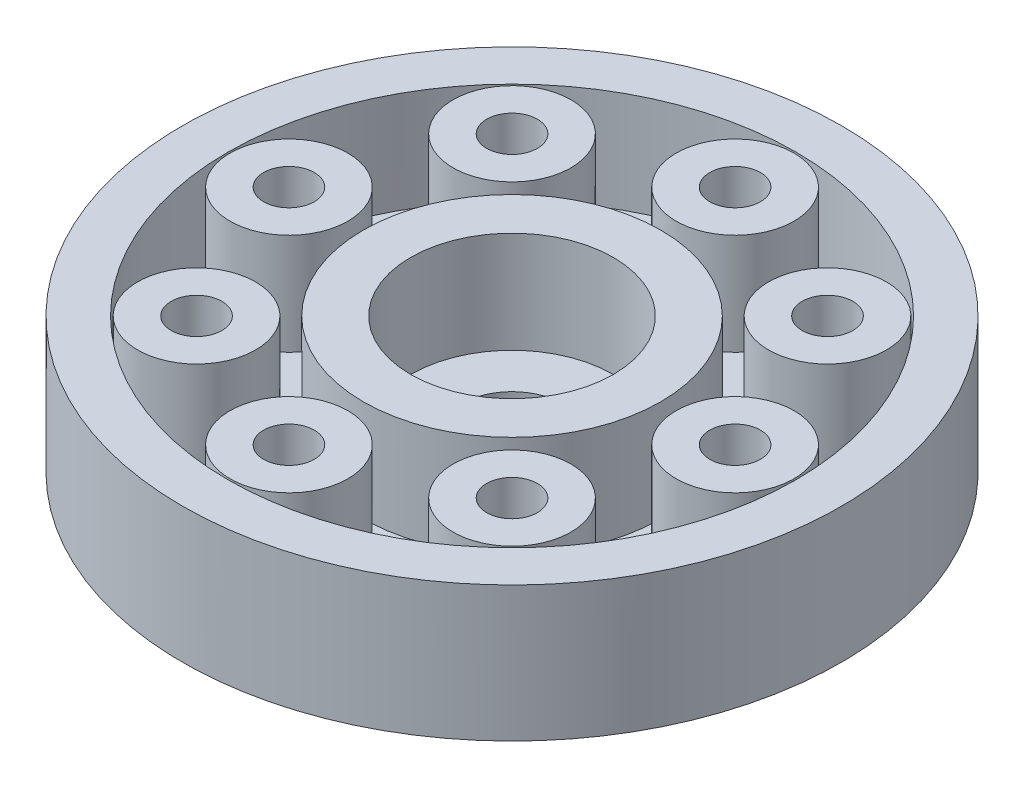
ISO-10303-21;
HEADER;
FILE_DESCRIPTION(('STEP AP214'),'2;1');
FILE_NAME('part.step','',(''),(''),'','','');
FILE_SCHEMA(('AUTOMOTIVE_DESIGN { 1 0 10303 214 1 1 1 1 }'));
ENDSEC;
DATA;
#1=APPLICATION_CONTEXT('core data for automotive mechanical design processes');
#2=APPLICATION_PROTOCOL_DEFINITION('international standard','automotive_design',2000,#1);
#3=PRODUCT_CONTEXT('',#1,'mechanical');
#4=PRODUCT('Part','Part','',(#3));
#5=PRODUCT_RELATED_PRODUCT_CATEGORY('part','',(#4));
#6=PRODUCT_DEFINITION_FORMATION('','',#4);
#7=PRODUCT_DEFINITION_CONTEXT('part definition',#1,'design');
#8=PRODUCT_DEFINITION('design','',#6,#7);
#9=PRODUCT_DEFINITION_SHAPE('','',#8);
#10=(LENGTH_UNIT() NAMED_UNIT(*) SI_UNIT(.MILLI.,.METRE.));
#11=(NAMED_UNIT(*) PLANE_ANGLE_UNIT() SI_UNIT($,.RADIAN.));
#12=(NAMED_UNIT(*) SI_UNIT($,.STERADIAN.) SOLID_ANGLE_UNIT());
#13=UNCERTAINTY_MEASURE_WITH_UNIT(LENGTH_MEASURE(1.E-05),#10,'distance_accuracy_value','');
#14=(GEOMETRIC_REPRESENTATION_CONTEXT(3) GLOBAL_UNCERTAINTY_ASSIGNED_CONTEXT((#13)) GLOBAL_UNIT_ASSIGNED_CONTEXT((#10,
#11,#12)) REPRESENTATION_CONTEXT('',''));
#15=CARTESIAN_POINT('',(0.,0.,0.));
#16=DIRECTION('',(0.,0.,1.));
#17=DIRECTION('',(1.,0.,0.));
#18=AXIS2_PLACEMENT_3D('',#15,#16,#17);
#19=CARTESIAN_POINT('',(0.394660743405106,3.,0.591991115107673));
#20=DIRECTION('',(0.,1.,0.));
#21=DIRECTION('',(0.,0.,1.));
#22=AXIS2_PLACEMENT_3D('',#19,#20,#21);
#23=PLANE('',#22);
#24=CARTESIAN_POINT('',(0.394660743405106,3.,0.591991115107673));
#25=DIRECTION('',(0.,1.,0.));
#26=DIRECTION('',(0.,0.,1.));
#27=AXIS2_PLACEMENT_3D('',#24,#25,#26);
#28=CIRCLE('',#27,4.4);
#29=CARTESIAN_POINT('',(0.394660743405106,3.,4.99199111510767));
#30=VERTEX_POINT('',#29);
#31=EDGE_CURVE('E50',#30,#30,#28,.T.);
#32=ORIENTED_EDGE('',*,*,#31,.T.);
#33=EDGE_LOOP('',(#32));
#34=FACE_BOUND('',#33,.T.);
#35=CARTESIAN_POINT('',(0.394660743405106,3.,0.591991115107673));
#36=DIRECTION('',(0.,1.,0.));
#37=DIRECTION('',(0.,0.,1.));
#38=AXIS2_PLACEMENT_3D('',#35,#36,#37);
#39=CIRCLE('',#38,3.);
#40=CARTESIAN_POINT('',(0.394660743405106,3.,3.59199111510767));
#41=VERTEX_POINT('',#40);
#42=EDGE_CURVE('E95',#41,#41,#39,.T.);
#43=ORIENTED_EDGE('',*,*,#42,.F.);
#44=EDGE_LOOP('',(#43));
#45=FACE_BOUND('',#44,.T.);
#46=ADVANCED_FACE('F34',(#34,#45),#23,.T.);
#47=CARTESIAN_POINT('',(0.394660743405106,3.,0.591991115107673));
#48=DIRECTION('',(0.,1.,0.));
#49=DIRECTION('',(0.,0.,1.));
#50=AXIS2_PLACEMENT_3D('',#47,#48,#49);
#51=CIRCLE('',#50,8.4);
#52=CARTESIAN_POINT('',(0.394660743405106,3.,8.99199111510768));
#53=VERTEX_POINT('',#52);
#54=EDGE_CURVE('E38',#53,#53,#51,.T.);
#55=ORIENTED_EDGE('',*,*,#54,.F.);
#56=EDGE_LOOP('',(#55));
#57=FACE_BOUND('',#56,.T.);
#58=CARTESIAN_POINT('',(0.394660743405106,3.,0.591991115107673));
#59=DIRECTION('',(0.,1.,0.));
#60=DIRECTION('',(0.,0.,1.));
#61=AXIS2_PLACEMENT_3D('',#58,#59,#60);
#62=CIRCLE('',#61,9.75);
#63=CARTESIAN_POINT('',(0.394660743405106,3.,10.3419911151077));
#64=VERTEX_POINT('',#63);
#65=EDGE_CURVE('E10',#64,#64,#62,.T.);
#66=ORIENTED_EDGE('',*,*,#65,.T.);
#67=EDGE_LOOP('',(#66));
#68=FACE_BOUND('',#67,.T.);
#69=ADVANCED_FACE('F84',(#57,#68),#23,.T.);
#70=CARTESIAN_POINT('',(0.394660743405106,3.,0.591991115107673));
#71=DIRECTION('',(0.,-1.,0.));
#72=DIRECTION('',(0.,0.,-1.));
#73=AXIS2_PLACEMENT_3D('',#70,#71,#72);
#74=CYLINDRICAL_SURFACE('',#73,9.75);
#75=ORIENTED_EDGE('',*,*,#65,.F.);
#76=EDGE_LOOP('',(#75));
#77=FACE_BOUND('',#76,.T.);
#78=CARTESIAN_POINT('',(0.394660743405106,-1.,0.591991115107673));
#79=DIRECTION('',(0.,-1.,0.));
#80=DIRECTION('',(0.,0.,-1.));
#81=AXIS2_PLACEMENT_3D('',#78,#79,#80);
#82=CIRCLE('',#81,9.75);
#83=CARTESIAN_POINT('',(0.394660743405106,-1.,-9.15800888489233));
#84=VERTEX_POINT('',#83);
#85=EDGE_CURVE('E42',#84,#84,#82,.T.);
#86=ORIENTED_EDGE('',*,*,#85,.F.);
#87=EDGE_LOOP('',(#86));
#88=FACE_BOUND('',#87,.T.);
#89=ADVANCED_FACE('F36',(#77,#88),#74,.T.);
#90=CARTESIAN_POINT('',(0.394660743405106,0.,0.591991115107673));
#91=DIRECTION('',(0.,-1.,0.));
#92=DIRECTION('',(0.,0.,-1.));
#93=AXIS2_PLACEMENT_3D('',#90,#91,#92);
#94=PLANE('',#93);
#95=CARTESIAN_POINT('',(0.394660743405106,0.,0.591991115107673));
#96=DIRECTION('',(0.,1.,0.));
#97=DIRECTION('',(0.,0.,1.));
#98=AXIS2_PLACEMENT_3D('',#95,#96,#97);
#99=CIRCLE('',#98,3.);
#100=CARTESIAN_POINT('',(0.394660743405106,0.,3.59199111510767));
#101=VERTEX_POINT('',#100);
#102=EDGE_CURVE('E98',#101,#101,#99,.T.);
#103=ORIENTED_EDGE('',*,*,#102,.T.);
#104=EDGE_LOOP('',(#103));
#105=FACE_BOUND('',#104,.T.);
#106=CARTESIAN_POINT('',(0.394660743405106,0.,0.591991115107673));
#107=DIRECTION('',(0.,1.,0.));
#108=DIRECTION('',(0.,0.,1.));
#109=AXIS2_PLACEMENT_3D('',#106,#107,#108);
#110=CIRCLE('',#109,1.5);
#111=CARTESIAN_POINT('',(0.394660743405106,0.,2.09199111510767));
#112=VERTEX_POINT('',#111);
#113=EDGE_CURVE('E56',#112,#112,#110,.T.);
#114=ORIENTED_EDGE('',*,*,#113,.F.);
#115=EDGE_LOOP('',(#114));
#116=FACE_BOUND('',#115,.T.);
#117=ADVANCED_FACE('F73',(#105,#116),#94,.F.);
#118=CARTESIAN_POINT('',(0.394660743405106,-1.,0.591991115107673));
#119=DIRECTION('',(0.,-1.,0.));
#120=DIRECTION('',(0.,0.,-1.));
#121=AXIS2_PLACEMENT_3D('',#118,#119,#120);
#122=PLANE('',#121);
#123=CARTESIAN_POINT('',(5.06156549923621,-1.,-4.07491364072347));
#124=DIRECTION('',(0.,-1.,0.));
#125=DIRECTION('',(0.,0.,-1.));
#126=AXIS2_PLACEMENT_3D('',#123,#124,#125);
#127=CIRCLE('',#126,0.749999999999999);
#128=CARTESIAN_POINT('',(5.06156549923621,-1.,-4.82491364072347));
#129=VERTEX_POINT('',#128);
#130=EDGE_CURVE('E97',#129,#129,#127,.T.);
#131=ORIENTED_EDGE('',*,*,#130,.F.);
#132=EDGE_LOOP('',(#131));
#133=FACE_BOUND('',#132,.T.);
#134=CARTESIAN_POINT('',(6.99466074340492,-1.,0.591991115107791));
#135=DIRECTION('',(0.,-1.,0.));
#136=DIRECTION('',(0.,0.,-1.));
#137=AXIS2_PLACEMENT_3D('',#134,#135,#136);
#138=CIRCLE('',#137,0.75);
#139=CARTESIAN_POINT('',(6.99466074340492,-1.,-0.158008884892209));
#140=VERTEX_POINT('',#139);
#141=EDGE_CURVE('E101',#140,#140,#138,.T.);
#142=ORIENTED_EDGE('',*,*,#141,.F.);
#143=EDGE_LOOP('',(#142));
#144=FACE_BOUND('',#143,.T.);
#145=CARTESIAN_POINT('',(5.06156549923604,-1.,5.25889587093898));
#146=DIRECTION('',(0.,-1.,0.));
#147=DIRECTION('',(0.,0.,-1.));
#148=AXIS2_PLACEMENT_3D('',#145,#146,#147);
#149=CIRCLE('',#148,0.75);
#150=CARTESIAN_POINT('',(5.06156549923604,-1.,4.50889587093898));
#151=VERTEX_POINT('',#150);
#152=EDGE_CURVE('E107',#151,#151,#149,.T.);
#153=ORIENTED_EDGE('',*,*,#152,.F.);
#154=EDGE_LOOP('',(#153));
#155=FACE_BOUND('',#154,.T.);
#156=CARTESIAN_POINT('',(0.39466074340478,-1.,7.19199111510767));
#157=DIRECTION('',(0.,-1.,0.));
#158=DIRECTION('',(0.,0.,-1.));
#159=AXIS2_PLACEMENT_3D('',#156,#157,#158);
#160=CIRCLE('',#159,0.75);
#161=CARTESIAN_POINT('',(0.39466074340478,-1.,6.44199111510767));
#162=VERTEX_POINT('',#161);
#163=EDGE_CURVE('E110',#162,#162,#160,.T.);
#164=ORIENTED_EDGE('',*,*,#163,.F.);
#165=EDGE_LOOP('',(#164));
#166=FACE_BOUND('',#165,.T.);
#167=CARTESIAN_POINT('',(-4.2722440124264,-1.,5.25889587093878));
#168=DIRECTION('',(0.,-1.,0.));
#169=DIRECTION('',(0.,0.,-1.));
#170=AXIS2_PLACEMENT_3D('',#167,#168,#169);
#171=CIRCLE('',#170,0.75);
#172=CARTESIAN_POINT('',(-4.2722440124264,-1.,4.50889587093878));
#173=VERTEX_POINT('',#172);
#174=EDGE_CURVE('E113',#173,#173,#171,.T.);
#175=ORIENTED_EDGE('',*,*,#174,.F.);
#176=EDGE_LOOP('',(#175));
#177=FACE_BOUND('',#176,.T.);
#178=CARTESIAN_POINT('',(-6.20533925659508,-1.,0.59199111510751));
#179=DIRECTION('',(0.,-1.,0.));
#180=DIRECTION('',(0.,0.,-1.));
#181=AXIS2_PLACEMENT_3D('',#178,#179,#180);
#182=CIRCLE('',#181,0.75);
#183=CARTESIAN_POINT('',(-6.20533925659508,-1.,-0.15800888489249));
#184=VERTEX_POINT('',#183);
#185=EDGE_CURVE('E116',#184,#184,#182,.T.);
#186=ORIENTED_EDGE('',*,*,#185,.F.);
#187=EDGE_LOOP('',(#186));
#188=FACE_BOUND('',#187,.T.);
#189=CARTESIAN_POINT('',(-4.27224401242617,-1.,-4.07491364072366));
#190=DIRECTION('',(0.,-1.,0.));
#191=DIRECTION('',(0.,0.,-1.));
#192=AXIS2_PLACEMENT_3D('',#189,#190,#191);
#193=CIRCLE('',#192,0.749999999999999);
#194=CARTESIAN_POINT('',(-4.27224401242617,-1.,-4.82491364072366));
#195=VERTEX_POINT('',#194);
#196=EDGE_CURVE('E119',#195,#195,#193,.T.);
#197=ORIENTED_EDGE('',*,*,#196,.F.);
#198=EDGE_LOOP('',(#197));
#199=FACE_BOUND('',#198,.T.);
#200=CARTESIAN_POINT('',(0.394660743405106,-1.,-6.00800888489233));
#201=DIRECTION('',(0.,-1.,0.));
#202=DIRECTION('',(0.,0.,-1.));
#203=AXIS2_PLACEMENT_3D('',#200,#201,#202);
#204=CIRCLE('',#203,0.75);
#205=CARTESIAN_POINT('',(0.394660743405106,-1.,-6.75800888489233));
#206=VERTEX_POINT('',#205);
#207=EDGE_CURVE('E122',#206,#206,#204,.T.);
#208=ORIENTED_EDGE('',*,*,#207,.F.);
#209=EDGE_LOOP('',(#208));
#210=FACE_BOUND('',#209,.T.);
#211=CARTESIAN_POINT('',(0.394660743405106,-1.,0.591991115107673));
#212=DIRECTION('',(0.,1.,0.));
#213=DIRECTION('',(0.,0.,1.));
#214=AXIS2_PLACEMENT_3D('',#211,#212,#213);
#215=CIRCLE('',#214,1.5);
#216=CARTESIAN_POINT('',(0.394660743405106,-1.,2.09199111510767));
#217=VERTEX_POINT('',#216);
#218=EDGE_CURVE('E47',#217,#217,#215,.T.);
#219=ORIENTED_EDGE('',*,*,#218,.T.);
#220=EDGE_LOOP('',(#219));
#221=FACE_BOUND('',#220,.T.);
#222=ORIENTED_EDGE('',*,*,#85,.T.);
#223=EDGE_LOOP('',(#222));
#224=FACE_BOUND('',#223,.T.);
#225=ADVANCED_FACE('F75',(#133,#144,#155,#166,#177,#188,#199,#210,#221,#224),#122,.T.);
#226=CARTESIAN_POINT('',(0.394660743405106,-1.,0.591991115107673));
#227=DIRECTION('',(0.,1.,0.));
#228=DIRECTION('',(0.,0.,1.));
#229=AXIS2_PLACEMENT_3D('',#226,#227,#228);
#230=CYLINDRICAL_SURFACE('',#229,1.5);
#231=ORIENTED_EDGE('',*,*,#218,.F.);
#232=EDGE_LOOP('',(#231));
#233=FACE_BOUND('',#232,.T.);
#234=ORIENTED_EDGE('',*,*,#113,.T.);
#235=EDGE_LOOP('',(#234));
#236=FACE_BOUND('',#235,.T.);
#237=ADVANCED_FACE('F71',(#233,#236),#230,.F.);
#238=CARTESIAN_POINT('',(0.394660743405106,10.,0.591991115107673));
#239=DIRECTION('',(0.,-1.,0.));
#240=DIRECTION('',(0.,0.,-1.));
#241=AXIS2_PLACEMENT_3D('',#238,#239,#240);
#242=CYLINDRICAL_SURFACE('',#241,8.4);
#243=ORIENTED_EDGE('',*,*,#54,.T.);
#244=EDGE_LOOP('',(#243));
#245=FACE_BOUND('',#244,.T.);
#246=CARTESIAN_POINT('',(0.394660743405106,0.,0.591991115107673));
#247=DIRECTION('',(0.,-1.,0.));
#248=DIRECTION('',(0.,0.,-1.));
#249=AXIS2_PLACEMENT_3D('',#246,#247,#248);
#250=CIRCLE('',#249,8.4);
#251=CARTESIAN_POINT('',(0.394660743405106,0.,-7.80800888489233));
#252=VERTEX_POINT('',#251);
#253=EDGE_CURVE('E52',#252,#252,#250,.T.);
#254=ORIENTED_EDGE('',*,*,#253,.T.);
#255=EDGE_LOOP('',(#254));
#256=FACE_BOUND('',#255,.T.);
#257=ADVANCED_FACE('F218',(#245,#256),#242,.F.);
#258=CARTESIAN_POINT('',(0.394660743405106,0.,0.591991115107673));
#259=DIRECTION('',(0.,-1.,0.));
#260=DIRECTION('',(0.,0.,-1.));
#261=AXIS2_PLACEMENT_3D('',#258,#259,#260);
#262=PLANE('',#261);
#263=CARTESIAN_POINT('',(5.06156549923621,0.,-4.07491364072347));
#264=DIRECTION('',(0.,-1.,0.));
#265=DIRECTION('',(0.,0.,-1.));
#266=AXIS2_PLACEMENT_3D('',#263,#264,#265);
#267=CIRCLE('',#266,1.7444823620493);
#268=CARTESIAN_POINT('',(5.06156549923621,0.,-5.81939600277277));
#269=VERTEX_POINT('',#268);
#270=EDGE_CURVE('E128',#269,#269,#267,.T.);
#271=ORIENTED_EDGE('',*,*,#270,.T.);
#272=EDGE_LOOP('',(#271));
#273=FACE_BOUND('',#272,.T.);
#274=CARTESIAN_POINT('',(6.99466074340492,0.,0.591991115107791));
#275=DIRECTION('',(0.,-1.,0.));
#276=DIRECTION('',(0.,0.,-1.));
#277=AXIS2_PLACEMENT_3D('',#274,#275,#276);
#278=CIRCLE('',#277,1.7444823620493);
#279=CARTESIAN_POINT('',(6.99466074340492,0.,-1.15249124694151));
#280=VERTEX_POINT('',#279);
#281=EDGE_CURVE('E137',#280,#280,#278,.T.);
#282=ORIENTED_EDGE('',*,*,#281,.T.);
#283=EDGE_LOOP('',(#282));
#284=FACE_BOUND('',#283,.T.);
#285=CARTESIAN_POINT('',(5.06156549923604,0.,5.25889587093898));
#286=DIRECTION('',(0.,-1.,0.));
#287=DIRECTION('',(0.,0.,-1.));
#288=AXIS2_PLACEMENT_3D('',#285,#286,#287);
#289=CIRCLE('',#288,1.7444823620493);
#290=CARTESIAN_POINT('',(5.06156549923604,0.,3.51441350888968));
#291=VERTEX_POINT('',#290);
#292=EDGE_CURVE('E146',#291,#291,#289,.T.);
#293=ORIENTED_EDGE('',*,*,#292,.T.);
#294=EDGE_LOOP('',(#293));
#295=FACE_BOUND('',#294,.T.);
#296=CARTESIAN_POINT('',(0.39466074340478,0.,7.19199111510767));
#297=DIRECTION('',(0.,-1.,0.));
#298=DIRECTION('',(0.,0.,-1.));
#299=AXIS2_PLACEMENT_3D('',#296,#297,#298);
#300=CIRCLE('',#299,1.7444823620493);
#301=CARTESIAN_POINT('',(0.39466074340478,0.,5.44750875305837));
#302=VERTEX_POINT('',#301);
#303=EDGE_CURVE('E155',#302,#302,#300,.T.);
#304=ORIENTED_EDGE('',*,*,#303,.T.);
#305=EDGE_LOOP('',(#304));
#306=FACE_BOUND('',#305,.T.);
#307=CARTESIAN_POINT('',(-4.2722440124264,0.,5.25889587093878));
#308=DIRECTION('',(0.,-1.,0.));
#309=DIRECTION('',(0.,0.,-1.));
#310=AXIS2_PLACEMENT_3D('',#307,#308,#309);
#311=CIRCLE('',#310,1.7444823620493);
#312=CARTESIAN_POINT('',(-4.2722440124264,0.,3.51441350888948));
#313=VERTEX_POINT('',#312);
#314=EDGE_CURVE('E164',#313,#313,#311,.T.);
#315=ORIENTED_EDGE('',*,*,#314,.T.);
#316=EDGE_LOOP('',(#315));
#317=FACE_BOUND('',#316,.T.);
#318=CARTESIAN_POINT('',(-6.20533925659508,0.,0.59199111510751));
#319=DIRECTION('',(0.,-1.,0.));
#320=DIRECTION('',(0.,0.,-1.));
#321=AXIS2_PLACEMENT_3D('',#318,#319,#320);
#322=CIRCLE('',#321,1.7444823620493);
#323=CARTESIAN_POINT('',(-6.20533925659508,0.,-1.15249124694179));
#324=VERTEX_POINT('',#323);
#325=EDGE_CURVE('E173',#324,#324,#322,.T.);
#326=ORIENTED_EDGE('',*,*,#325,.T.);
#327=EDGE_LOOP('',(#326));
#328=FACE_BOUND('',#327,.T.);
#329=CARTESIAN_POINT('',(-4.27224401242617,0.,-4.07491364072366));
#330=DIRECTION('',(0.,-1.,0.));
#331=DIRECTION('',(0.,0.,-1.));
#332=AXIS2_PLACEMENT_3D('',#329,#330,#331);
#333=CIRCLE('',#332,1.7444823620493);
#334=CARTESIAN_POINT('',(-4.27224401242617,0.,-5.81939600277296));
#335=VERTEX_POINT('',#334);
#336=EDGE_CURVE('E182',#335,#335,#333,.T.);
#337=ORIENTED_EDGE('',*,*,#336,.T.);
#338=EDGE_LOOP('',(#337));
#339=FACE_BOUND('',#338,.T.);
#340=CARTESIAN_POINT('',(0.394660743405106,0.,-6.00800888489233));
#341=DIRECTION('',(0.,-1.,0.));
#342=DIRECTION('',(0.,0.,-1.));
#343=AXIS2_PLACEMENT_3D('',#340,#341,#342);
#344=CIRCLE('',#343,1.7444823620493);
#345=CARTESIAN_POINT('',(0.394660743405106,0.,-7.75249124694163));
#346=VERTEX_POINT('',#345);
#347=EDGE_CURVE('E191',#346,#346,#344,.T.);
#348=ORIENTED_EDGE('',*,*,#347,.T.);
#349=EDGE_LOOP('',(#348));
#350=FACE_BOUND('',#349,.T.);
#351=CARTESIAN_POINT('',(0.394660743405106,0.,0.591991115107673));
#352=DIRECTION('',(0.,-1.,0.));
#353=DIRECTION('',(0.,0.,-1.));
#354=AXIS2_PLACEMENT_3D('',#351,#352,#353);
#355=CIRCLE('',#354,4.4);
#356=CARTESIAN_POINT('',(0.394660743405106,0.,-3.80800888489233));
#357=VERTEX_POINT('',#356);
#358=EDGE_CURVE('E58',#357,#357,#355,.T.);
#359=ORIENTED_EDGE('',*,*,#358,.T.);
#360=EDGE_LOOP('',(#359));
#361=FACE_BOUND('',#360,.T.);
#362=ORIENTED_EDGE('',*,*,#253,.F.);
#363=EDGE_LOOP('',(#362));
#364=FACE_BOUND('',#363,.T.);
#365=ADVANCED_FACE('F196',(#273,#284,#295,#306,#317,#328,#339,#350,#361,#364),#262,.F.);
#366=CARTESIAN_POINT('',(0.394660743405106,10.,0.591991115107673));
#367=DIRECTION('',(0.,-1.,0.));
#368=DIRECTION('',(0.,0.,-1.));
#369=AXIS2_PLACEMENT_3D('',#366,#367,#368);
#370=CYLINDRICAL_SURFACE('',#369,4.4);
#371=ORIENTED_EDGE('',*,*,#31,.F.);
#372=EDGE_LOOP('',(#371));
#373=FACE_BOUND('',#372,.T.);
#374=ORIENTED_EDGE('',*,*,#358,.F.);
#375=EDGE_LOOP('',(#374));
#376=FACE_BOUND('',#375,.T.);
#377=ADVANCED_FACE('F202',(#373,#376),#370,.T.);
#378=CARTESIAN_POINT('',(0.394660743405106,3.,-6.00800888489233));
#379=DIRECTION('',(0.,-1.,0.));
#380=DIRECTION('',(0.,0.,-1.));
#381=AXIS2_PLACEMENT_3D('',#378,#379,#380);
#382=CYLINDRICAL_SURFACE('',#381,1.7444823620493);
#383=CARTESIAN_POINT('',(0.394660743405106,3.,-6.00800888489233));
#384=DIRECTION('',(0.,-1.,0.));
#385=DIRECTION('',(0.,0.,-1.));
#386=AXIS2_PLACEMENT_3D('',#383,#384,#385);
#387=CIRCLE('',#386,1.7444823620493);
#388=CARTESIAN_POINT('',(0.394660743405106,3.,-7.75249124694163));
#389=VERTEX_POINT('',#388);
#390=EDGE_CURVE('E63',#389,#389,#387,.T.);
#391=ORIENTED_EDGE('',*,*,#390,.T.);
#392=EDGE_LOOP('',(#391));
#393=FACE_BOUND('',#392,.T.);
#394=ORIENTED_EDGE('',*,*,#347,.F.);
#395=EDGE_LOOP('',(#394));
#396=FACE_BOUND('',#395,.T.);
#397=ADVANCED_FACE('F199',(#393,#396),#382,.T.);
#398=CARTESIAN_POINT('',(0.394660743405106,3.,-6.00800888489233));
#399=DIRECTION('',(0.,-1.,0.));
#400=DIRECTION('',(0.,0.,-1.));
#401=AXIS2_PLACEMENT_3D('',#398,#399,#400);
#402=PLANE('',#401);
#403=CARTESIAN_POINT('',(0.394660743405106,3.,-6.00800888489233));
#404=DIRECTION('',(0.,-1.,0.));
#405=DIRECTION('',(0.,0.,-1.));
#406=AXIS2_PLACEMENT_3D('',#403,#404,#405);
#407=CIRCLE('',#406,0.75);
#408=CARTESIAN_POINT('',(0.394660743405106,3.,-6.75800888489233));
#409=VERTEX_POINT('',#408);
#410=EDGE_CURVE('E186',#409,#409,#407,.T.);
#411=ORIENTED_EDGE('',*,*,#410,.T.);
#412=EDGE_LOOP('',(#411));
#413=FACE_BOUND('',#412,.T.);
#414=ORIENTED_EDGE('',*,*,#390,.F.);
#415=EDGE_LOOP('',(#414));
#416=FACE_BOUND('',#415,.T.);
#417=ADVANCED_FACE('F201',(#413,#416),#402,.F.);
#418=CARTESIAN_POINT('',(0.394660743405106,3.,-6.00800888489233));
#419=DIRECTION('',(0.,-1.,0.));
#420=DIRECTION('',(0.,0.,-1.));
#421=AXIS2_PLACEMENT_3D('',#418,#419,#420);
#422=CYLINDRICAL_SURFACE('',#421,0.75);
#423=ORIENTED_EDGE('',*,*,#207,.T.);
#424=EDGE_LOOP('',(#423));
#425=FACE_BOUND('',#424,.T.);
#426=ORIENTED_EDGE('',*,*,#410,.F.);
#427=EDGE_LOOP('',(#426));
#428=FACE_BOUND('',#427,.T.);
#429=ADVANCED_FACE('F209',(#425,#428),#422,.F.);
#430=CARTESIAN_POINT('',(-4.27224401242617,3.,-4.07491364072366));
#431=DIRECTION('',(0.,-1.,0.));
#432=DIRECTION('',(0.,0.,-1.));
#433=AXIS2_PLACEMENT_3D('',#430,#431,#432);
#434=CYLINDRICAL_SURFACE('',#433,1.7444823620493);
#435=CARTESIAN_POINT('',(-4.27224401242617,3.,-4.07491364072366));
#436=DIRECTION('',(0.,-1.,0.));
#437=DIRECTION('',(0.,0.,-1.));
#438=AXIS2_PLACEMENT_3D('',#435,#436,#437);
#439=CIRCLE('',#438,1.7444823620493);
#440=CARTESIAN_POINT('',(-4.27224401242617,3.,-5.81939600277296));
#441=VERTEX_POINT('',#440);
#442=EDGE_CURVE('E183',#441,#441,#439,.T.);
#443=ORIENTED_EDGE('',*,*,#442,.T.);
#444=EDGE_LOOP('',(#443));
#445=FACE_BOUND('',#444,.T.);
#446=ORIENTED_EDGE('',*,*,#336,.F.);
#447=EDGE_LOOP('',(#446));
#448=FACE_BOUND('',#447,.T.);
#449=ADVANCED_FACE('F270',(#445,#448),#434,.T.);
#450=CARTESIAN_POINT('',(-4.27224401242617,3.,-4.07491364072366));
#451=DIRECTION('',(0.,-1.,0.));
#452=DIRECTION('',(0.,0.,-1.));
#453=AXIS2_PLACEMENT_3D('',#450,#451,#452);
#454=PLANE('',#453);
#455=CARTESIAN_POINT('',(-4.27224401242616,3.,-4.07491364072367));
#456=DIRECTION('',(0.,-1.,0.));
#457=DIRECTION('',(0.,0.,-1.));
#458=AXIS2_PLACEMENT_3D('',#455,#456,#457);
#459=CIRCLE('',#458,0.750000000000001);
#460=CARTESIAN_POINT('',(-4.27224401242616,3.,-4.82491364072368));
#461=VERTEX_POINT('',#460);
#462=EDGE_CURVE('E177',#461,#461,#459,.T.);
#463=ORIENTED_EDGE('',*,*,#462,.T.);
#464=EDGE_LOOP('',(#463));
#465=FACE_BOUND('',#464,.T.);
#466=ORIENTED_EDGE('',*,*,#442,.F.);
#467=EDGE_LOOP('',(#466));
#468=FACE_BOUND('',#467,.T.);
#469=ADVANCED_FACE('F281',(#465,#468),#454,.F.);
#470=CARTESIAN_POINT('',(-4.27224401242616,3.,-4.07491364072367));
#471=DIRECTION('',(0.,-1.,0.));
#472=DIRECTION('',(0.,0.,-1.));
#473=AXIS2_PLACEMENT_3D('',#470,#471,#472);
#474=CYLINDRICAL_SURFACE('',#473,0.750000000000001);
#475=ORIENTED_EDGE('',*,*,#196,.T.);
#476=EDGE_LOOP('',(#475));
#477=FACE_BOUND('',#476,.T.);
#478=ORIENTED_EDGE('',*,*,#462,.F.);
#479=EDGE_LOOP('',(#478));
#480=FACE_BOUND('',#479,.T.);
#481=ADVANCED_FACE('F290',(#477,#480),#474,.F.);
#482=CARTESIAN_POINT('',(-6.20533925659508,3.,0.59199111510751));
#483=DIRECTION('',(0.,-1.,0.));
#484=DIRECTION('',(0.,0.,-1.));
#485=AXIS2_PLACEMENT_3D('',#482,#483,#484);
#486=CYLINDRICAL_SURFACE('',#485,1.7444823620493);
#487=CARTESIAN_POINT('',(-6.20533925659508,3.,0.59199111510751));
#488=DIRECTION('',(0.,-1.,0.));
#489=DIRECTION('',(0.,0.,-1.));
#490=AXIS2_PLACEMENT_3D('',#487,#488,#489);
#491=CIRCLE('',#490,1.7444823620493);
#492=CARTESIAN_POINT('',(-6.20533925659508,3.,-1.15249124694179));
#493=VERTEX_POINT('',#492);
#494=EDGE_CURVE('E174',#493,#493,#491,.T.);
#495=ORIENTED_EDGE('',*,*,#494,.T.);
#496=EDGE_LOOP('',(#495));
#497=FACE_BOUND('',#496,.T.);
#498=ORIENTED_EDGE('',*,*,#325,.F.);
#499=EDGE_LOOP('',(#498));
#500=FACE_BOUND('',#499,.T.);
#501=ADVANCED_FACE('F299',(#497,#500),#486,.T.);
#502=CARTESIAN_POINT('',(-6.20533925659508,3.,0.59199111510751));
#503=DIRECTION('',(0.,-1.,0.));
#504=DIRECTION('',(0.,0.,-1.));
#505=AXIS2_PLACEMENT_3D('',#502,#503,#504);
#506=PLANE('',#505);
#507=CARTESIAN_POINT('',(-6.20533925659508,3.,0.591991115107482));
#508=DIRECTION('',(0.,-1.,0.));
#509=DIRECTION('',(0.,0.,-1.));
#510=AXIS2_PLACEMENT_3D('',#507,#508,#509);
#511=CIRCLE('',#510,0.75);
#512=CARTESIAN_POINT('',(-6.20533925659508,3.,-0.158008884892518));
#513=VERTEX_POINT('',#512);
#514=EDGE_CURVE('E168',#513,#513,#511,.T.);
#515=ORIENTED_EDGE('',*,*,#514,.T.);
#516=EDGE_LOOP('',(#515));
#517=FACE_BOUND('',#516,.T.);
#518=ORIENTED_EDGE('',*,*,#494,.F.);
#519=EDGE_LOOP('',(#518));
#520=FACE_BOUND('',#519,.T.);
#521=ADVANCED_FACE('F310',(#517,#520),#506,.F.);
#522=CARTESIAN_POINT('',(-6.20533925659508,3.,0.591991115107482));
#523=DIRECTION('',(0.,-1.,0.));
#524=DIRECTION('',(0.,0.,-1.));
#525=AXIS2_PLACEMENT_3D('',#522,#523,#524);
#526=CYLINDRICAL_SURFACE('',#525,0.75);
#527=ORIENTED_EDGE('',*,*,#185,.T.);
#528=EDGE_LOOP('',(#527));
#529=FACE_BOUND('',#528,.T.);
#530=ORIENTED_EDGE('',*,*,#514,.F.);
#531=EDGE_LOOP('',(#530));
#532=FACE_BOUND('',#531,.T.);
#533=ADVANCED_FACE('F319',(#529,#532),#526,.F.);
#534=CARTESIAN_POINT('',(-4.2722440124264,3.,5.25889587093878));
#535=DIRECTION('',(0.,-1.,0.));
#536=DIRECTION('',(0.,0.,-1.));
#537=AXIS2_PLACEMENT_3D('',#534,#535,#536);
#538=CYLINDRICAL_SURFACE('',#537,1.7444823620493);
#539=CARTESIAN_POINT('',(-4.2722440124264,3.,5.25889587093878));
#540=DIRECTION('',(0.,-1.,0.));
#541=DIRECTION('',(0.,0.,-1.));
#542=AXIS2_PLACEMENT_3D('',#539,#540,#541);
#543=CIRCLE('',#542,1.7444823620493);
#544=CARTESIAN_POINT('',(-4.2722440124264,3.,3.51441350888948));
#545=VERTEX_POINT('',#544);
#546=EDGE_CURVE('E165',#545,#545,#543,.T.);
#547=ORIENTED_EDGE('',*,*,#546,.T.);
#548=EDGE_LOOP('',(#547));
#549=FACE_BOUND('',#548,.T.);
#550=ORIENTED_EDGE('',*,*,#314,.F.);
#551=EDGE_LOOP('',(#550));
#552=FACE_BOUND('',#551,.T.);
#553=ADVANCED_FACE('F328',(#549,#552),#538,.T.);
#554=CARTESIAN_POINT('',(-4.2722440124264,3.,5.25889587093878));
#555=DIRECTION('',(0.,-1.,0.));
#556=DIRECTION('',(0.,0.,-1.));
#557=AXIS2_PLACEMENT_3D('',#554,#555,#556);
#558=PLANE('',#557);
#559=CARTESIAN_POINT('',(-4.27224401242643,3.,5.25889587093875));
#560=DIRECTION('',(0.,-1.,0.));
#561=DIRECTION('',(0.,0.,-1.));
#562=AXIS2_PLACEMENT_3D('',#559,#560,#561);
#563=CIRCLE('',#562,0.75);
#564=CARTESIAN_POINT('',(-4.27224401242643,3.,4.50889587093875));
#565=VERTEX_POINT('',#564);
#566=EDGE_CURVE('E159',#565,#565,#563,.T.);
#567=ORIENTED_EDGE('',*,*,#566,.T.);
#568=EDGE_LOOP('',(#567));
#569=FACE_BOUND('',#568,.T.);
#570=ORIENTED_EDGE('',*,*,#546,.F.);
#571=EDGE_LOOP('',(#570));
#572=FACE_BOUND('',#571,.T.);
#573=ADVANCED_FACE('F339',(#569,#572),#558,.F.);
#574=CARTESIAN_POINT('',(-4.27224401242643,3.,5.25889587093875));
#575=DIRECTION('',(0.,-1.,0.));
#576=DIRECTION('',(0.,0.,-1.));
#577=AXIS2_PLACEMENT_3D('',#574,#575,#576);
#578=CYLINDRICAL_SURFACE('',#577,0.75);
#579=ORIENTED_EDGE('',*,*,#174,.T.);
#580=EDGE_LOOP('',(#579));
#581=FACE_BOUND('',#580,.T.);
#582=ORIENTED_EDGE('',*,*,#566,.F.);
#583=EDGE_LOOP('',(#582));
#584=FACE_BOUND('',#583,.T.);
#585=ADVANCED_FACE('F348',(#581,#584),#578,.F.);
#586=CARTESIAN_POINT('',(0.39466074340478,3.,7.19199111510767));
#587=DIRECTION('',(0.,-1.,0.));
#588=DIRECTION('',(0.,0.,-1.));
#589=AXIS2_PLACEMENT_3D('',#586,#587,#588);
#590=CYLINDRICAL_SURFACE('',#589,1.7444823620493);
#591=CARTESIAN_POINT('',(0.39466074340478,3.,7.19199111510767));
#592=DIRECTION('',(0.,-1.,0.));
#593=DIRECTION('',(0.,0.,-1.));
#594=AXIS2_PLACEMENT_3D('',#591,#592,#593);
#595=CIRCLE('',#594,1.7444823620493);
#596=CARTESIAN_POINT('',(0.39466074340478,3.,5.44750875305837));
#597=VERTEX_POINT('',#596);
#598=EDGE_CURVE('E156',#597,#597,#595,.T.);
#599=ORIENTED_EDGE('',*,*,#598,.T.);
#600=EDGE_LOOP('',(#599));
#601=FACE_BOUND('',#600,.T.);
#602=ORIENTED_EDGE('',*,*,#303,.F.);
#603=EDGE_LOOP('',(#602));
#604=FACE_BOUND('',#603,.T.);
#605=ADVANCED_FACE('F357',(#601,#604),#590,.T.);
#606=CARTESIAN_POINT('',(0.39466074340478,3.,7.19199111510767));
#607=DIRECTION('',(0.,-1.,0.));
#608=DIRECTION('',(0.,0.,-1.));
#609=AXIS2_PLACEMENT_3D('',#606,#607,#608);
#610=PLANE('',#609);
#611=CARTESIAN_POINT('',(0.394660743404724,3.,7.19199111510767));
#612=DIRECTION('',(0.,-1.,0.));
#613=DIRECTION('',(0.,0.,-1.));
#614=AXIS2_PLACEMENT_3D('',#611,#612,#613);
#615=CIRCLE('',#614,0.75);
#616=CARTESIAN_POINT('',(0.394660743404724,3.,6.44199111510767));
#617=VERTEX_POINT('',#616);
#618=EDGE_CURVE('E150',#617,#617,#615,.T.);
#619=ORIENTED_EDGE('',*,*,#618,.T.);
#620=EDGE_LOOP('',(#619));
#621=FACE_BOUND('',#620,.T.);
#622=ORIENTED_EDGE('',*,*,#598,.F.);
#623=EDGE_LOOP('',(#622));
#624=FACE_BOUND('',#623,.T.);
#625=ADVANCED_FACE('F368',(#621,#624),#610,.F.);
#626=CARTESIAN_POINT('',(0.394660743404724,3.,7.19199111510767));
#627=DIRECTION('',(0.,-1.,0.));
#628=DIRECTION('',(0.,0.,-1.));
#629=AXIS2_PLACEMENT_3D('',#626,#627,#628);
#630=CYLINDRICAL_SURFACE('',#629,0.75);
#631=ORIENTED_EDGE('',*,*,#163,.T.);
#632=EDGE_LOOP('',(#631));
#633=FACE_BOUND('',#632,.T.);
#634=ORIENTED_EDGE('',*,*,#618,.F.);
#635=EDGE_LOOP('',(#634));
#636=FACE_BOUND('',#635,.T.);
#637=ADVANCED_FACE('F377',(#633,#636),#630,.F.);
#638=CARTESIAN_POINT('',(5.06156549923604,3.,5.25889587093898));
#639=DIRECTION('',(0.,-1.,0.));
#640=DIRECTION('',(0.,0.,-1.));
#641=AXIS2_PLACEMENT_3D('',#638,#639,#640);
#642=CYLINDRICAL_SURFACE('',#641,1.7444823620493);
#643=CARTESIAN_POINT('',(5.06156549923604,3.,5.25889587093898));
#644=DIRECTION('',(0.,-1.,0.));
#645=DIRECTION('',(0.,0.,-1.));
#646=AXIS2_PLACEMENT_3D('',#643,#644,#645);
#647=CIRCLE('',#646,1.7444823620493);
#648=CARTESIAN_POINT('',(5.06156549923604,3.,3.51441350888968));
#649=VERTEX_POINT('',#648);
#650=EDGE_CURVE('E147',#649,#649,#647,.T.);
#651=ORIENTED_EDGE('',*,*,#650,.T.);
#652=EDGE_LOOP('',(#651));
#653=FACE_BOUND('',#652,.T.);
#654=ORIENTED_EDGE('',*,*,#292,.F.);
#655=EDGE_LOOP('',(#654));
#656=FACE_BOUND('',#655,.T.);
#657=ADVANCED_FACE('F386',(#653,#656),#642,.T.);
#658=CARTESIAN_POINT('',(5.06156549923604,3.,5.25889587093898));
#659=DIRECTION('',(0.,-1.,0.));
#660=DIRECTION('',(0.,0.,-1.));
#661=AXIS2_PLACEMENT_3D('',#658,#659,#660);
#662=PLANE('',#661);
#663=CARTESIAN_POINT('',(5.06156549923599,3.,5.25889587093902));
#664=DIRECTION('',(0.,-1.,0.));
#665=DIRECTION('',(0.,0.,-1.));
#666=AXIS2_PLACEMENT_3D('',#663,#664,#665);
#667=CIRCLE('',#666,0.750000000000001);
#668=CARTESIAN_POINT('',(5.06156549923599,3.,4.50889587093902));
#669=VERTEX_POINT('',#668);
#670=EDGE_CURVE('E141',#669,#669,#667,.T.);
#671=ORIENTED_EDGE('',*,*,#670,.T.);
#672=EDGE_LOOP('',(#671));
#673=FACE_BOUND('',#672,.T.);
#674=ORIENTED_EDGE('',*,*,#650,.F.);
#675=EDGE_LOOP('',(#674));
#676=FACE_BOUND('',#675,.T.);
#677=ADVANCED_FACE('F397',(#673,#676),#662,.F.);
#678=CARTESIAN_POINT('',(5.06156549923599,3.,5.25889587093902));
#679=DIRECTION('',(0.,-1.,0.));
#680=DIRECTION('',(0.,0.,-1.));
#681=AXIS2_PLACEMENT_3D('',#678,#679,#680);
#682=CYLINDRICAL_SURFACE('',#681,0.750000000000001);
#683=ORIENTED_EDGE('',*,*,#152,.T.);
#684=EDGE_LOOP('',(#683));
#685=FACE_BOUND('',#684,.T.);
#686=ORIENTED_EDGE('',*,*,#670,.F.);
#687=EDGE_LOOP('',(#686));
#688=FACE_BOUND('',#687,.T.);
#689=ADVANCED_FACE('F406',(#685,#688),#682,.F.);
#690=CARTESIAN_POINT('',(6.99466074340492,3.,0.591991115107791));
#691=DIRECTION('',(0.,-1.,0.));
#692=DIRECTION('',(0.,0.,-1.));
#693=AXIS2_PLACEMENT_3D('',#690,#691,#692);
#694=CYLINDRICAL_SURFACE('',#693,1.7444823620493);
#695=CARTESIAN_POINT('',(6.99466074340492,3.,0.591991115107791));
#696=DIRECTION('',(0.,-1.,0.));
#697=DIRECTION('',(0.,0.,-1.));
#698=AXIS2_PLACEMENT_3D('',#695,#696,#697);
#699=CIRCLE('',#698,1.7444823620493);
#700=CARTESIAN_POINT('',(6.99466074340492,3.,-1.15249124694151));
#701=VERTEX_POINT('',#700);
#702=EDGE_CURVE('E138',#701,#701,#699,.T.);
#703=ORIENTED_EDGE('',*,*,#702,.T.);
#704=EDGE_LOOP('',(#703));
#705=FACE_BOUND('',#704,.T.);
#706=ORIENTED_EDGE('',*,*,#281,.F.);
#707=EDGE_LOOP('',(#706));
#708=FACE_BOUND('',#707,.T.);
#709=ADVANCED_FACE('F415',(#705,#708),#694,.T.);
#710=CARTESIAN_POINT('',(6.99466074340492,3.,0.591991115107791));
#711=DIRECTION('',(0.,-1.,0.));
#712=DIRECTION('',(0.,0.,-1.));
#713=AXIS2_PLACEMENT_3D('',#710,#711,#712);
#714=PLANE('',#713);
#715=CARTESIAN_POINT('',(6.99466074340492,3.,0.591991115107865));
#716=DIRECTION('',(0.,-1.,0.));
#717=DIRECTION('',(0.,0.,-1.));
#718=AXIS2_PLACEMENT_3D('',#715,#716,#717);
#719=CIRCLE('',#718,0.75);
#720=CARTESIAN_POINT('',(6.99466074340492,3.,-0.158008884892135));
#721=VERTEX_POINT('',#720);
#722=EDGE_CURVE('E132',#721,#721,#719,.T.);
#723=ORIENTED_EDGE('',*,*,#722,.T.);
#724=EDGE_LOOP('',(#723));
#725=FACE_BOUND('',#724,.T.);
#726=ORIENTED_EDGE('',*,*,#702,.F.);
#727=EDGE_LOOP('',(#726));
#728=FACE_BOUND('',#727,.T.);
#729=ADVANCED_FACE('F426',(#725,#728),#714,.F.);
#730=CARTESIAN_POINT('',(6.99466074340492,3.,0.591991115107865));
#731=DIRECTION('',(0.,-1.,0.));
#732=DIRECTION('',(0.,0.,-1.));
#733=AXIS2_PLACEMENT_3D('',#730,#731,#732);
#734=CYLINDRICAL_SURFACE('',#733,0.75);
#735=ORIENTED_EDGE('',*,*,#141,.T.);
#736=EDGE_LOOP('',(#735));
#737=FACE_BOUND('',#736,.T.);
#738=ORIENTED_EDGE('',*,*,#722,.F.);
#739=EDGE_LOOP('',(#738));
#740=FACE_BOUND('',#739,.T.);
#741=ADVANCED_FACE('F435',(#737,#740),#734,.F.);
#742=CARTESIAN_POINT('',(5.06156549923621,3.,-4.07491364072347));
#743=DIRECTION('',(0.,-1.,0.));
#744=DIRECTION('',(0.,0.,-1.));
#745=AXIS2_PLACEMENT_3D('',#742,#743,#744);
#746=CYLINDRICAL_SURFACE('',#745,1.7444823620493);
#747=CARTESIAN_POINT('',(5.06156549923621,3.,-4.07491364072347));
#748=DIRECTION('',(0.,-1.,0.));
#749=DIRECTION('',(0.,0.,-1.));
#750=AXIS2_PLACEMENT_3D('',#747,#748,#749);
#751=CIRCLE('',#750,1.7444823620493);
#752=CARTESIAN_POINT('',(5.06156549923621,3.,-5.81939600277277));
#753=VERTEX_POINT('',#752);
#754=EDGE_CURVE('E129',#753,#753,#751,.T.);
#755=ORIENTED_EDGE('',*,*,#754,.T.);
#756=EDGE_LOOP('',(#755));
#757=FACE_BOUND('',#756,.T.);
#758=ORIENTED_EDGE('',*,*,#270,.F.);
#759=EDGE_LOOP('',(#758));
#760=FACE_BOUND('',#759,.T.);
#761=ADVANCED_FACE('F444',(#757,#760),#746,.T.);
#762=CARTESIAN_POINT('',(5.06156549923621,3.,-4.07491364072347));
#763=DIRECTION('',(0.,-1.,0.));
#764=DIRECTION('',(0.,0.,-1.));
#765=AXIS2_PLACEMENT_3D('',#762,#763,#764);
#766=PLANE('',#765);
#767=CARTESIAN_POINT('',(5.06156549923627,3.,-4.0749136407234));
#768=DIRECTION('',(0.,-1.,0.));
#769=DIRECTION('',(0.,0.,-1.));
#770=AXIS2_PLACEMENT_3D('',#767,#768,#769);
#771=CIRCLE('',#770,0.749999999999998);
#772=CARTESIAN_POINT('',(5.06156549923627,3.,-4.8249136407234));
#773=VERTEX_POINT('',#772);
#774=EDGE_CURVE('E125',#773,#773,#771,.T.);
#775=ORIENTED_EDGE('',*,*,#774,.T.);
#776=EDGE_LOOP('',(#775));
#777=FACE_BOUND('',#776,.T.);
#778=ORIENTED_EDGE('',*,*,#754,.F.);
#779=EDGE_LOOP('',(#778));
#780=FACE_BOUND('',#779,.T.);
#781=ADVANCED_FACE('F455',(#777,#780),#766,.F.);
#782=CARTESIAN_POINT('',(5.06156549923627,3.,-4.0749136407234));
#783=DIRECTION('',(0.,-1.,0.));
#784=DIRECTION('',(0.,0.,-1.));
#785=AXIS2_PLACEMENT_3D('',#782,#783,#784);
#786=CYLINDRICAL_SURFACE('',#785,0.749999999999998);
#787=ORIENTED_EDGE('',*,*,#130,.T.);
#788=EDGE_LOOP('',(#787));
#789=FACE_BOUND('',#788,.T.);
#790=ORIENTED_EDGE('',*,*,#774,.F.);
#791=EDGE_LOOP('',(#790));
#792=FACE_BOUND('',#791,.T.);
#793=ADVANCED_FACE('F463',(#789,#792),#786,.F.);
#794=CARTESIAN_POINT('',(0.394660743405106,3.,0.591991115107673));
#795=DIRECTION('',(0.,-1.,0.));
#796=DIRECTION('',(0.,0.,-1.));
#797=AXIS2_PLACEMENT_3D('',#794,#795,#796);
#798=CYLINDRICAL_SURFACE('',#797,3.);
#799=ORIENTED_EDGE('',*,*,#42,.T.);
#800=EDGE_LOOP('',(#799));
#801=FACE_BOUND('',#800,.T.);
#802=ORIENTED_EDGE('',*,*,#102,.F.);
#803=EDGE_LOOP('',(#802));
#804=FACE_BOUND('',#803,.T.);
#805=ADVANCED_FACE('F470',(#801,#804),#798,.F.);
#806=CLOSED_SHELL('',(#46,#69,#89,#117,#225,#237,#257,#365,#377,#397,#417,#429,#449,#469,#481,
#501,#521,#533,#553,#573,#585,#605,#625,#637,#657,#677,#689,#709,#729,#741,#761,#781,#793,#805));
#807=MANIFOLD_SOLID_BREP('B2',#806);
#808=ADVANCED_BREP_SHAPE_REPRESENTATION('',(#18,#807),#14);
#809=SHAPE_DEFINITION_REPRESENTATION(#9,#808);
ENDSEC;
END-ISO-10303-21;
